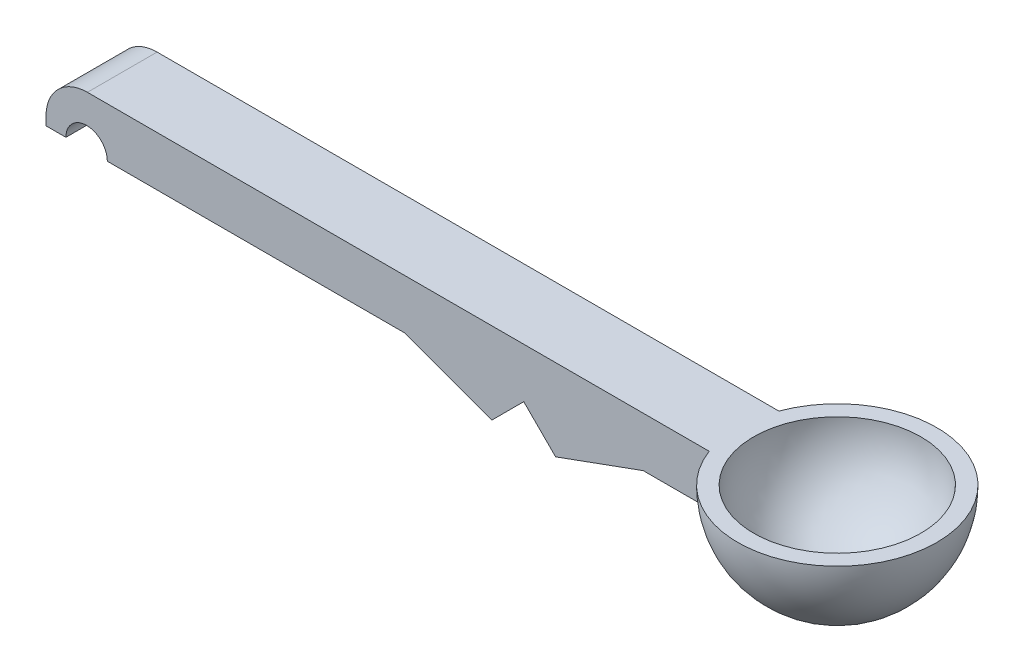
ISO-10303-21;
HEADER;
FILE_DESCRIPTION(('STEP AP214'),'2;1');
FILE_NAME('part.step','',(''),(''),'','','');
FILE_SCHEMA(('AUTOMOTIVE_DESIGN { 1 0 10303 214 1 1 1 1 }'));
ENDSEC;
DATA;
#1=APPLICATION_CONTEXT('core data for automotive mechanical design processes');
#2=APPLICATION_PROTOCOL_DEFINITION('international standard','automotive_design',2000,#1);
#3=PRODUCT_CONTEXT('',#1,'mechanical');
#4=PRODUCT('Part','Part','',(#3));
#5=PRODUCT_RELATED_PRODUCT_CATEGORY('part','',(#4));
#6=PRODUCT_DEFINITION_FORMATION('','',#4);
#7=PRODUCT_DEFINITION_CONTEXT('part definition',#1,'design');
#8=PRODUCT_DEFINITION('design','',#6,#7);
#9=PRODUCT_DEFINITION_SHAPE('','',#8);
#10=(LENGTH_UNIT() NAMED_UNIT(*) SI_UNIT(.MILLI.,.METRE.));
#11=(NAMED_UNIT(*) PLANE_ANGLE_UNIT() SI_UNIT($,.RADIAN.));
#12=(NAMED_UNIT(*) SI_UNIT($,.STERADIAN.) SOLID_ANGLE_UNIT());
#13=UNCERTAINTY_MEASURE_WITH_UNIT(LENGTH_MEASURE(1.E-05),#10,'distance_accuracy_value','');
#14=(GEOMETRIC_REPRESENTATION_CONTEXT(3) GLOBAL_UNCERTAINTY_ASSIGNED_CONTEXT((#13)) GLOBAL_UNIT_ASSIGNED_CONTEXT((#10,
#11,#12)) REPRESENTATION_CONTEXT('',''));
#15=CARTESIAN_POINT('',(0.,0.,0.));
#16=DIRECTION('',(0.,0.,1.));
#17=DIRECTION('',(1.,0.,0.));
#18=AXIS2_PLACEMENT_3D('',#15,#16,#17);
#19=CARTESIAN_POINT('',(107.95,7.9375,0.));
#20=DIRECTION('',(-1.,0.,0.));
#21=DIRECTION('',(0.,0.,1.));
#22=AXIS2_PLACEMENT_3D('',#19,#20,#21);
#23=PLANE('',#22);
#24=DIRECTION('',(0.,-1.,0.));
#25=VECTOR('',#24,1.);
#26=CARTESIAN_POINT('',(107.95,7.9375,-11.1125));
#27=LINE('',#26,#25);
#28=CARTESIAN_POINT('',(107.95,0.200981988807868,-11.1125));
#29=VERTEX_POINT('',#28);
#30=CARTESIAN_POINT('',(107.95,0.,-11.1125));
#31=VERTEX_POINT('',#30);
#32=EDGE_CURVE('E206',#29,#31,#27,.T.);
#33=ORIENTED_EDGE('',*,*,#32,.F.);
#34=CARTESIAN_POINT('',(107.95,7.9375,-5.55625000000001));
#35=DIRECTION('',(-1.,0.,0.));
#36=DIRECTION('',(0.,0.,1.));
#37=AXIS2_PLACEMENT_3D('',#34,#35,#36);
#38=CIRCLE('',#37,9.52500000000001);
#39=CARTESIAN_POINT('',(107.95,0.,-10.8213918546892));
#40=VERTEX_POINT('',#39);
#41=EDGE_CURVE('E173',#29,#40,#38,.T.);
#42=ORIENTED_EDGE('',*,*,#41,.T.);
#43=DIRECTION('',(0.,0.,-1.));
#44=VECTOR('',#43,1.);
#45=CARTESIAN_POINT('',(107.95,0.,0.));
#46=LINE('',#45,#44);
#47=EDGE_CURVE('E200',#40,#31,#46,.T.);
#48=ORIENTED_EDGE('',*,*,#47,.T.);
#49=EDGE_LOOP('',(#33,#42,#48));
#50=FACE_BOUND('',#49,.T.);
#51=ADVANCED_FACE('F56',(#50),#23,.F.);
#52=CARTESIAN_POINT('',(0.,0.,0.));
#53=DIRECTION('',(0.,-1.,0.));
#54=DIRECTION('',(0.,0.,-1.));
#55=AXIS2_PLACEMENT_3D('',#52,#53,#54);
#56=PLANE('',#55);
#57=CARTESIAN_POINT('',(16.129,0.,-5.55625));
#58=DIRECTION('',(0.,-1.,0.));
#59=DIRECTION('',(0.,0.,-1.));
#60=AXIS2_PLACEMENT_3D('',#57,#58,#59);
#61=CIRCLE('',#60,3.175);
#62=CARTESIAN_POINT('',(16.129,0.,-8.73125));
#63=VERTEX_POINT('',#62);
#64=EDGE_CURVE('E373',#63,#63,#61,.T.);
#65=ORIENTED_EDGE('',*,*,#64,.F.);
#66=EDGE_LOOP('',(#65));
#67=FACE_BOUND('',#66,.T.);
#68=DIRECTION('',(0.,0.,1.));
#69=VECTOR('',#68,1.);
#70=CARTESIAN_POINT('',(57.15,0.,-11.1125));
#71=LINE('',#70,#69);
#72=CARTESIAN_POINT('',(57.15,0.,-11.1125));
#73=VERTEX_POINT('',#72);
#74=CARTESIAN_POINT('',(57.15,0.,0.));
#75=VERTEX_POINT('',#74);
#76=EDGE_CURVE('E245',#73,#75,#71,.T.);
#77=ORIENTED_EDGE('',*,*,#76,.T.);
#78=DIRECTION('',(1.,0.,0.));
#79=VECTOR('',#78,1.);
#80=CARTESIAN_POINT('',(0.,0.,0.));
#81=LINE('',#80,#79);
#82=CARTESIAN_POINT('',(9.779,0.,0.));
#83=VERTEX_POINT('',#82);
#84=EDGE_CURVE('E201',#83,#75,#81,.T.);
#85=ORIENTED_EDGE('',*,*,#84,.F.);
#86=DIRECTION('',(0.,0.,-1.));
#87=VECTOR('',#86,1.);
#88=CARTESIAN_POINT('',(9.779,0.,136.012947812538));
#89=LINE('',#88,#87);
#90=CARTESIAN_POINT('',(9.779,0.,-11.1125));
#91=VERTEX_POINT('',#90);
#92=EDGE_CURVE('E211',#83,#91,#89,.T.);
#93=ORIENTED_EDGE('',*,*,#92,.T.);
#94=DIRECTION('',(-1.,0.,0.));
#95=VECTOR('',#94,1.);
#96=CARTESIAN_POINT('',(0.,0.,-11.1125));
#97=LINE('',#96,#95);
#98=EDGE_CURVE('E186',#73,#91,#97,.T.);
#99=ORIENTED_EDGE('',*,*,#98,.F.);
#100=EDGE_LOOP('',(#77,#85,#93,#99));
#101=FACE_BOUND('',#100,.T.);
#102=ADVANCED_FACE('F246',(#67,#101),#56,.T.);
#103=CARTESIAN_POINT('',(0.,7.9375,0.));
#104=DIRECTION('',(0.,0.,-1.));
#105=DIRECTION('',(-1.,0.,0.));
#106=AXIS2_PLACEMENT_3D('',#103,#104,#105);
#107=PLANE('',#106);
#108=DIRECTION('',(0.,-1.,0.));
#109=VECTOR('',#108,1.);
#110=CARTESIAN_POINT('',(107.95,7.9375,0.));
#111=LINE('',#110,#109);
#112=CARTESIAN_POINT('',(107.95,0.200981988807883,0.));
#113=VERTEX_POINT('',#112);
#114=CARTESIAN_POINT('',(107.95,0.,0.));
#115=VERTEX_POINT('',#114);
#116=EDGE_CURVE('E172',#113,#115,#111,.T.);
#117=ORIENTED_EDGE('',*,*,#116,.F.);
#118=CARTESIAN_POINT('',(120.65,7.9375,0.));
#119=DIRECTION('',(0.,0.,-1.));
#120=DIRECTION('',(-1.,0.,0.));
#121=AXIS2_PLACEMENT_3D('',#118,#119,#120);
#122=CIRCLE('',#121,14.8709014836862);
#123=CARTESIAN_POINT('',(105.779098516314,7.93749999999996,0.));
#124=VERTEX_POINT('',#123);
#125=EDGE_CURVE('E159',#113,#124,#122,.T.);
#126=ORIENTED_EDGE('',*,*,#125,.T.);
#127=DIRECTION('',(1.,0.,0.));
#128=VECTOR('',#127,1.);
#129=CARTESIAN_POINT('',(0.,7.9375,0.));
#130=LINE('',#129,#128);
#131=CARTESIAN_POINT('',(6.604,7.9375,0.));
#132=VERTEX_POINT('',#131);
#133=EDGE_CURVE('E170',#132,#124,#130,.T.);
#134=ORIENTED_EDGE('',*,*,#133,.F.);
#135=CARTESIAN_POINT('',(6.604,1.3335,0.));
#136=DIRECTION('',(0.,0.,-1.));
#137=DIRECTION('',(-1.,0.,0.));
#138=AXIS2_PLACEMENT_3D('',#135,#136,#137);
#139=CIRCLE('',#138,6.604);
#140=CARTESIAN_POINT('',(0.,1.3335,0.));
#141=VERTEX_POINT('',#140);
#142=EDGE_CURVE('E79',#132,#141,#139,.F.);
#143=ORIENTED_EDGE('',*,*,#142,.T.);
#144=DIRECTION('',(0.,-1.,0.));
#145=VECTOR('',#144,1.);
#146=CARTESIAN_POINT('',(0.,7.9375,0.));
#147=LINE('',#146,#145);
#148=CARTESIAN_POINT('',(0.,0.,0.));
#149=VERTEX_POINT('',#148);
#150=EDGE_CURVE('E209',#141,#149,#147,.T.);
#151=ORIENTED_EDGE('',*,*,#150,.T.);
#152=CARTESIAN_POINT('',(3.175,0.,0.));
#153=VERTEX_POINT('',#152);
#154=EDGE_CURVE('E197',#149,#153,#81,.T.);
#155=ORIENTED_EDGE('',*,*,#154,.T.);
#156=CARTESIAN_POINT('',(6.477,0.,0.));
#157=DIRECTION('',(0.,0.,-1.));
#158=DIRECTION('',(-1.,0.,0.));
#159=AXIS2_PLACEMENT_3D('',#156,#157,#158);
#160=CIRCLE('',#159,3.302);
#161=EDGE_CURVE('E190',#83,#153,#160,.F.);
#162=ORIENTED_EDGE('',*,*,#161,.F.);
#163=ORIENTED_EDGE('',*,*,#84,.T.);
#164=DIRECTION('',(0.939793423488437,-0.341743063086704,0.));
#165=VECTOR('',#164,1.);
#166=CARTESIAN_POINT('',(6.67445255474451,18.3547445255474,0.));
#167=LINE('',#166,#165);
#168=CARTESIAN_POINT('',(71.12,-5.08,0.));
#169=VERTEX_POINT('',#168);
#170=EDGE_CURVE('E279',#75,#169,#167,.T.);
#171=ORIENTED_EDGE('',*,*,#170,.T.);
#172=DIRECTION('',(0.707106781186546,0.707106781186549,0.));
#173=VECTOR('',#172,1.);
#174=CARTESIAN_POINT('',(38.1000000000002,-38.1,0.));
#175=LINE('',#174,#173);
#176=CARTESIAN_POINT('',(76.2,0.,0.));
#177=VERTEX_POINT('',#176);
#178=EDGE_CURVE('E284',#169,#177,#175,.T.);
#179=ORIENTED_EDGE('',*,*,#178,.T.);
#180=DIRECTION('',(0.707106781186547,-0.707106781186548,0.));
#181=VECTOR('',#180,1.);
#182=CARTESIAN_POINT('',(38.1000000000001,38.1,0.));
#183=LINE('',#182,#181);
#184=CARTESIAN_POINT('',(81.28,-5.08,0.));
#185=VERTEX_POINT('',#184);
#186=EDGE_CURVE('E277',#177,#185,#183,.T.);
#187=ORIENTED_EDGE('',*,*,#186,.T.);
#188=DIRECTION('',(0.939793423488437,0.341743063086704,0.));
#189=VECTOR('',#188,1.);
#190=CARTESIAN_POINT('',(11.1240875912409,-30.5912408759124,0.));
#191=LINE('',#190,#189);
#192=CARTESIAN_POINT('',(95.25,0.,0.));
#193=VERTEX_POINT('',#192);
#194=EDGE_CURVE('E253',#185,#193,#191,.T.);
#195=ORIENTED_EDGE('',*,*,#194,.T.);
#196=EDGE_CURVE('E196',#193,#115,#81,.T.);
#197=ORIENTED_EDGE('',*,*,#196,.T.);
#198=EDGE_LOOP('',(#117,#126,#134,#143,#151,#155,#162,#163,#171,#179,#187,#195,#197));
#199=FACE_BOUND('',#198,.T.);
#200=ADVANCED_FACE('F169',(#199),#107,.F.);
#201=CARTESIAN_POINT('',(0.,7.9375,-11.1125));
#202=DIRECTION('',(0.,0.,1.));
#203=DIRECTION('',(1.,0.,0.));
#204=AXIS2_PLACEMENT_3D('',#201,#202,#203);
#205=PLANE('',#204);
#206=DIRECTION('',(-1.,0.,0.));
#207=VECTOR('',#206,1.);
#208=CARTESIAN_POINT('',(0.,7.9375,-11.1125));
#209=LINE('',#208,#207);
#210=CARTESIAN_POINT('',(105.779098516314,7.93750000000004,-11.1125));
#211=VERTEX_POINT('',#210);
#212=CARTESIAN_POINT('',(6.604,7.9375,-11.1125));
#213=VERTEX_POINT('',#212);
#214=EDGE_CURVE('E180',#211,#213,#209,.T.);
#215=ORIENTED_EDGE('',*,*,#214,.F.);
#216=CARTESIAN_POINT('',(120.65,7.9375,-11.1125));
#217=DIRECTION('',(0.,0.,1.));
#218=DIRECTION('',(1.,0.,0.));
#219=AXIS2_PLACEMENT_3D('',#216,#217,#218);
#220=CIRCLE('',#219,14.8709014836862);
#221=EDGE_CURVE('E162',#211,#29,#220,.T.);
#222=ORIENTED_EDGE('',*,*,#221,.T.);
#223=ORIENTED_EDGE('',*,*,#32,.T.);
#224=CARTESIAN_POINT('',(95.25,0.,-11.1125));
#225=VERTEX_POINT('',#224);
#226=EDGE_CURVE('E181',#31,#225,#97,.T.);
#227=ORIENTED_EDGE('',*,*,#226,.T.);
#228=DIRECTION('',(0.939793423488437,0.341743063086704,0.));
#229=VECTOR('',#228,1.);
#230=CARTESIAN_POINT('',(11.1240875912409,-30.5912408759124,-11.1125));
#231=LINE('',#230,#229);
#232=CARTESIAN_POINT('',(81.28,-5.08,-11.1125));
#233=VERTEX_POINT('',#232);
#234=EDGE_CURVE('E274',#233,#225,#231,.T.);
#235=ORIENTED_EDGE('',*,*,#234,.F.);
#236=DIRECTION('',(0.707106781186547,-0.707106781186548,0.));
#237=VECTOR('',#236,1.);
#238=CARTESIAN_POINT('',(38.1000000000001,38.1,-11.1125));
#239=LINE('',#238,#237);
#240=CARTESIAN_POINT('',(76.2,0.,-11.1125));
#241=VERTEX_POINT('',#240);
#242=EDGE_CURVE('E267',#241,#233,#239,.T.);
#243=ORIENTED_EDGE('',*,*,#242,.F.);
#244=DIRECTION('',(0.707106781186546,0.707106781186549,0.));
#245=VECTOR('',#244,1.);
#246=CARTESIAN_POINT('',(38.1000000000002,-38.1,-11.1125));
#247=LINE('',#246,#245);
#248=CARTESIAN_POINT('',(71.12,-5.08,-11.1125));
#249=VERTEX_POINT('',#248);
#250=EDGE_CURVE('E283',#249,#241,#247,.T.);
#251=ORIENTED_EDGE('',*,*,#250,.F.);
#252=DIRECTION('',(0.939793423488437,-0.341743063086704,0.));
#253=VECTOR('',#252,1.);
#254=CARTESIAN_POINT('',(6.67445255474451,18.3547445255474,-11.1125));
#255=LINE('',#254,#253);
#256=EDGE_CURVE('E241',#73,#249,#255,.T.);
#257=ORIENTED_EDGE('',*,*,#256,.F.);
#258=ORIENTED_EDGE('',*,*,#98,.T.);
#259=CARTESIAN_POINT('',(6.477,0.,-11.1125));
#260=DIRECTION('',(0.,0.,1.));
#261=DIRECTION('',(1.,0.,0.));
#262=AXIS2_PLACEMENT_3D('',#259,#260,#261);
#263=CIRCLE('',#262,3.302);
#264=CARTESIAN_POINT('',(3.175,0.,-11.1124999999999));
#265=VERTEX_POINT('',#264);
#266=EDGE_CURVE('E236',#265,#91,#263,.F.);
#267=ORIENTED_EDGE('',*,*,#266,.F.);
#268=CARTESIAN_POINT('',(0.,0.,-11.1125));
#269=VERTEX_POINT('',#268);
#270=EDGE_CURVE('E188',#265,#269,#97,.T.);
#271=ORIENTED_EDGE('',*,*,#270,.T.);
#272=DIRECTION('',(0.,-1.,0.));
#273=VECTOR('',#272,1.);
#274=CARTESIAN_POINT('',(0.,7.9375,-11.1125));
#275=LINE('',#274,#273);
#276=CARTESIAN_POINT('',(0.,1.3335,-11.1125));
#277=VERTEX_POINT('',#276);
#278=EDGE_CURVE('E183',#277,#269,#275,.T.);
#279=ORIENTED_EDGE('',*,*,#278,.F.);
#280=CARTESIAN_POINT('',(6.604,1.3335,-11.1125));
#281=DIRECTION('',(0.,0.,1.));
#282=DIRECTION('',(1.,0.,0.));
#283=AXIS2_PLACEMENT_3D('',#280,#281,#282);
#284=CIRCLE('',#283,6.604);
#285=EDGE_CURVE('E12',#277,#213,#284,.F.);
#286=ORIENTED_EDGE('',*,*,#285,.T.);
#287=EDGE_LOOP('',(#215,#222,#223,#227,#235,#243,#251,#257,#258,#267,#271,#279,#286));
#288=FACE_BOUND('',#287,.T.);
#289=ADVANCED_FACE('F235',(#288),#205,.F.);
#290=ORIENTED_EDGE('',*,*,#270,.F.);
#291=DIRECTION('',(0.,0.,-1.));
#292=VECTOR('',#291,1.);
#293=CARTESIAN_POINT('',(3.175,0.,136.012947812538));
#294=LINE('',#293,#292);
#295=EDGE_CURVE('E214',#265,#153,#294,.F.);
#296=ORIENTED_EDGE('',*,*,#295,.T.);
#297=ORIENTED_EDGE('',*,*,#154,.F.);
#298=DIRECTION('',(0.,0.,1.));
#299=VECTOR('',#298,1.);
#300=CARTESIAN_POINT('',(0.,0.,0.));
#301=LINE('',#300,#299);
#302=EDGE_CURVE('E193',#269,#149,#301,.T.);
#303=ORIENTED_EDGE('',*,*,#302,.F.);
#304=EDGE_LOOP('',(#290,#296,#297,#303));
#305=FACE_BOUND('',#304,.T.);
#306=ADVANCED_FACE('F222',(#305),#56,.T.);
#307=CARTESIAN_POINT('',(120.65,0.,-5.55625000000001));
#308=DIRECTION('',(0.,-1.,0.));
#309=DIRECTION('',(0.,0.,-1.));
#310=AXIS2_PLACEMENT_3D('',#307,#308,#309);
#311=CIRCLE('',#310,13.748153285078);
#312=CARTESIAN_POINT('',(107.95,0.,-0.2911081453108));
#313=VERTEX_POINT('',#312);
#314=EDGE_CURVE('E174',#313,#40,#311,.T.);
#315=ORIENTED_EDGE('',*,*,#314,.F.);
#316=EDGE_CURVE('E202',#115,#313,#46,.T.);
#317=ORIENTED_EDGE('',*,*,#316,.F.);
#318=ORIENTED_EDGE('',*,*,#196,.F.);
#319=DIRECTION('',(0.,0.,1.));
#320=VECTOR('',#319,1.);
#321=CARTESIAN_POINT('',(95.25,0.,-11.1125));
#322=LINE('',#321,#320);
#323=EDGE_CURVE('E275',#225,#193,#322,.T.);
#324=ORIENTED_EDGE('',*,*,#323,.F.);
#325=ORIENTED_EDGE('',*,*,#226,.F.);
#326=ORIENTED_EDGE('',*,*,#47,.F.);
#327=EDGE_LOOP('',(#315,#317,#318,#324,#325,#326));
#328=FACE_BOUND('',#327,.T.);
#329=ADVANCED_FACE('F257',(#328),#56,.T.);
#330=CARTESIAN_POINT('',(0.,7.9375,0.));
#331=DIRECTION('',(1.,0.,0.));
#332=DIRECTION('',(0.,0.,-1.));
#333=AXIS2_PLACEMENT_3D('',#330,#331,#332);
#334=PLANE('',#333);
#335=ORIENTED_EDGE('',*,*,#150,.F.);
#336=DIRECTION('',(0.,0.,1.));
#337=VECTOR('',#336,1.);
#338=CARTESIAN_POINT('',(0.,1.3335,0.));
#339=LINE('',#338,#337);
#340=EDGE_CURVE('E65',#141,#277,#339,.F.);
#341=ORIENTED_EDGE('',*,*,#340,.T.);
#342=ORIENTED_EDGE('',*,*,#278,.T.);
#343=ORIENTED_EDGE('',*,*,#302,.T.);
#344=EDGE_LOOP('',(#335,#341,#342,#343));
#345=FACE_BOUND('',#344,.T.);
#346=ADVANCED_FACE('F231',(#345),#334,.F.);
#347=ORIENTED_EDGE('',*,*,#316,.T.);
#348=EDGE_CURVE('E166',#313,#113,#38,.T.);
#349=ORIENTED_EDGE('',*,*,#348,.T.);
#350=ORIENTED_EDGE('',*,*,#116,.T.);
#351=EDGE_LOOP('',(#347,#349,#350));
#352=FACE_BOUND('',#351,.T.);
#353=ADVANCED_FACE('F260',(#352),#23,.F.);
#354=CARTESIAN_POINT('',(0.,7.9375,0.));
#355=DIRECTION('',(0.,-1.,0.));
#356=DIRECTION('',(0.,0.,-1.));
#357=AXIS2_PLACEMENT_3D('',#354,#355,#356);
#358=PLANE('',#357);
#359=CARTESIAN_POINT('',(120.65,7.9375,-5.55625000000001));
#360=DIRECTION('',(0.,-1.,0.));
#361=DIRECTION('',(0.,0.,-1.));
#362=AXIS2_PLACEMENT_3D('',#359,#360,#361);
#363=CIRCLE('',#362,13.335);
#364=CARTESIAN_POINT('',(120.65,7.9375,-18.89125));
#365=VERTEX_POINT('',#364);
#366=EDGE_CURVE('E60',#365,#365,#363,.F.);
#367=ORIENTED_EDGE('',*,*,#366,.F.);
#368=EDGE_LOOP('',(#367));
#369=FACE_BOUND('',#368,.T.);
#370=CARTESIAN_POINT('',(120.65,7.9375,-5.55625000000001));
#371=DIRECTION('',(0.,-1.,0.));
#372=DIRECTION('',(0.,0.,-1.));
#373=AXIS2_PLACEMENT_3D('',#370,#371,#372);
#374=CIRCLE('',#373,15.875);
#375=EDGE_CURVE('E156',#211,#124,#374,.T.);
#376=ORIENTED_EDGE('',*,*,#375,.F.);
#377=ORIENTED_EDGE('',*,*,#214,.T.);
#378=DIRECTION('',(0.,0.,1.));
#379=VECTOR('',#378,1.);
#380=CARTESIAN_POINT('',(6.604,7.9375,0.));
#381=LINE('',#380,#379);
#382=EDGE_CURVE('E179',#213,#132,#381,.T.);
#383=ORIENTED_EDGE('',*,*,#382,.T.);
#384=ORIENTED_EDGE('',*,*,#133,.T.);
#385=EDGE_LOOP('',(#376,#377,#383,#384));
#386=FACE_BOUND('',#385,.T.);
#387=ADVANCED_FACE('F177',(#369,#386),#358,.F.);
#388=CARTESIAN_POINT('',(6.477,0.,136.012947812538));
#389=DIRECTION('',(0.,0.,-1.));
#390=DIRECTION('',(-1.,0.,0.));
#391=AXIS2_PLACEMENT_3D('',#388,#389,#390);
#392=CYLINDRICAL_SURFACE('',#391,3.302);
#393=ORIENTED_EDGE('',*,*,#92,.F.);
#394=ORIENTED_EDGE('',*,*,#161,.T.);
#395=ORIENTED_EDGE('',*,*,#295,.F.);
#396=ORIENTED_EDGE('',*,*,#266,.T.);
#397=EDGE_LOOP('',(#393,#394,#395,#396));
#398=FACE_BOUND('',#397,.T.);
#399=ADVANCED_FACE('F244',(#398),#392,.F.);
#400=CARTESIAN_POINT('',(6.67445255474451,18.3547445255474,-11.1125));
#401=DIRECTION('',(-0.341743063086704,-0.939793423488437,0.));
#402=DIRECTION('',(0.939793423488437,-0.341743063086704,0.));
#403=AXIS2_PLACEMENT_3D('',#400,#401,#402);
#404=PLANE('',#403);
#405=ORIENTED_EDGE('',*,*,#170,.F.);
#406=ORIENTED_EDGE('',*,*,#76,.F.);
#407=ORIENTED_EDGE('',*,*,#256,.T.);
#408=DIRECTION('',(0.,0.,1.));
#409=VECTOR('',#408,1.);
#410=CARTESIAN_POINT('',(71.12,-5.08,-11.1125));
#411=LINE('',#410,#409);
#412=EDGE_CURVE('E287',#249,#169,#411,.T.);
#413=ORIENTED_EDGE('',*,*,#412,.T.);
#414=EDGE_LOOP('',(#405,#406,#407,#413));
#415=FACE_BOUND('',#414,.T.);
#416=ADVANCED_FACE('F297',(#415),#404,.T.);
#417=CARTESIAN_POINT('',(38.1000000000002,-38.1,-11.1125));
#418=DIRECTION('',(0.707106781186549,-0.707106781186546,0.));
#419=DIRECTION('',(0.707106781186546,0.707106781186549,0.));
#420=AXIS2_PLACEMENT_3D('',#417,#418,#419);
#421=PLANE('',#420);
#422=ORIENTED_EDGE('',*,*,#178,.F.);
#423=ORIENTED_EDGE('',*,*,#412,.F.);
#424=ORIENTED_EDGE('',*,*,#250,.T.);
#425=DIRECTION('',(0.,0.,1.));
#426=VECTOR('',#425,1.);
#427=CARTESIAN_POINT('',(76.2,0.,-11.1125));
#428=LINE('',#427,#426);
#429=EDGE_CURVE('E292',#241,#177,#428,.T.);
#430=ORIENTED_EDGE('',*,*,#429,.T.);
#431=EDGE_LOOP('',(#422,#423,#424,#430));
#432=FACE_BOUND('',#431,.T.);
#433=ADVANCED_FACE('F299',(#432),#421,.T.);
#434=CARTESIAN_POINT('',(38.1000000000001,38.1,-11.1125));
#435=DIRECTION('',(-0.707106781186548,-0.707106781186547,0.));
#436=DIRECTION('',(0.707106781186547,-0.707106781186548,0.));
#437=AXIS2_PLACEMENT_3D('',#434,#435,#436);
#438=PLANE('',#437);
#439=ORIENTED_EDGE('',*,*,#186,.F.);
#440=ORIENTED_EDGE('',*,*,#429,.F.);
#441=ORIENTED_EDGE('',*,*,#242,.T.);
#442=DIRECTION('',(0.,0.,1.));
#443=VECTOR('',#442,1.);
#444=CARTESIAN_POINT('',(81.28,-5.08,-11.1125));
#445=LINE('',#444,#443);
#446=EDGE_CURVE('E270',#233,#185,#445,.T.);
#447=ORIENTED_EDGE('',*,*,#446,.T.);
#448=EDGE_LOOP('',(#439,#440,#441,#447));
#449=FACE_BOUND('',#448,.T.);
#450=ADVANCED_FACE('F301',(#449),#438,.T.);
#451=CARTESIAN_POINT('',(11.1240875912409,-30.5912408759124,-11.1125));
#452=DIRECTION('',(0.341743063086704,-0.939793423488437,0.));
#453=DIRECTION('',(0.939793423488437,0.341743063086704,0.));
#454=AXIS2_PLACEMENT_3D('',#451,#452,#453);
#455=PLANE('',#454);
#456=ORIENTED_EDGE('',*,*,#194,.F.);
#457=ORIENTED_EDGE('',*,*,#446,.F.);
#458=ORIENTED_EDGE('',*,*,#234,.T.);
#459=ORIENTED_EDGE('',*,*,#323,.T.);
#460=EDGE_LOOP('',(#456,#457,#458,#459));
#461=FACE_BOUND('',#460,.T.);
#462=ADVANCED_FACE('F305',(#461),#455,.T.);
#463=CARTESIAN_POINT('',(6.604,1.3335,0.));
#464=DIRECTION('',(0.,0.,1.));
#465=DIRECTION('',(1.,0.,0.));
#466=AXIS2_PLACEMENT_3D('',#463,#464,#465);
#467=CYLINDRICAL_SURFACE('',#466,6.604);
#468=ORIENTED_EDGE('',*,*,#285,.F.);
#469=ORIENTED_EDGE('',*,*,#340,.F.);
#470=ORIENTED_EDGE('',*,*,#142,.F.);
#471=ORIENTED_EDGE('',*,*,#382,.F.);
#472=EDGE_LOOP('',(#468,#469,#470,#471));
#473=FACE_BOUND('',#472,.T.);
#474=ADVANCED_FACE('F58',(#473),#467,.T.);
#475=CARTESIAN_POINT('',(120.65,7.9375,-5.55625000000001));
#476=DIRECTION('',(-1.,0.,0.));
#477=DIRECTION('',(0.,0.,1.));
#478=AXIS2_PLACEMENT_3D('',#475,#476,#477);
#479=SPHERICAL_SURFACE('',#478,15.875);
#480=ORIENTED_EDGE('',*,*,#221,.F.);
#481=ORIENTED_EDGE('',*,*,#375,.T.);
#482=ORIENTED_EDGE('',*,*,#125,.F.);
#483=ORIENTED_EDGE('',*,*,#348,.F.);
#484=ORIENTED_EDGE('',*,*,#314,.T.);
#485=ORIENTED_EDGE('',*,*,#41,.F.);
#486=EDGE_LOOP('',(#480,#481,#482,#483,#484,#485));
#487=FACE_BOUND('',#486,.T.);
#488=ADVANCED_FACE('F158',(#487),#479,.T.);
#489=CARTESIAN_POINT('',(120.65,7.9375,-5.55625000000001));
#490=DIRECTION('',(1.,0.,0.));
#491=DIRECTION('',(0.,0.,1.));
#492=AXIS2_PLACEMENT_3D('',#489,#490,#491);
#493=SPHERICAL_SURFACE('',#492,13.335);
#494=CARTESIAN_POINT('',(120.65,7.9375,-5.55625000000001));
#495=DIRECTION('',(0.,-1.,0.));
#496=DIRECTION('',(0.,0.,-1.));
#497=AXIS2_PLACEMENT_3D('',#494,#495,#496);
#498=SPHERICAL_SURFACE('',#497,13.335);
#499=ORIENTED_EDGE('',*,*,#366,.T.);
#500=EDGE_LOOP('',(#499));
#501=FACE_BOUND('',#500,.T.);
#502=ADVANCED_FACE('F346',(#501),#498,.F.);
#503=CARTESIAN_POINT('',(16.129,4.953,-5.55625));
#504=DIRECTION('',(0.,1.,0.));
#505=DIRECTION('',(0.,0.,1.));
#506=AXIS2_PLACEMENT_3D('',#503,#504,#505);
#507=PLANE('',#506);
#508=CARTESIAN_POINT('',(16.129,4.953,-5.55625));
#509=DIRECTION('',(0.,-1.,0.));
#510=DIRECTION('',(0.,0.,-1.));
#511=AXIS2_PLACEMENT_3D('',#508,#509,#510);
#512=CIRCLE('',#511,3.556);
#513=CARTESIAN_POINT('',(16.129,4.953,-9.11225));
#514=VERTEX_POINT('',#513);
#515=EDGE_CURVE('E380',#514,#514,#512,.T.);
#516=ORIENTED_EDGE('',*,*,#515,.T.);
#517=EDGE_LOOP('',(#516));
#518=FACE_BOUND('',#517,.T.);
#519=ADVANCED_FACE('F349',(#518),#507,.F.);
#520=CARTESIAN_POINT('',(16.129,0.,-5.55625));
#521=DIRECTION('',(0.,-1.,0.));
#522=DIRECTION('',(0.,0.,-1.));
#523=AXIS2_PLACEMENT_3D('',#520,#521,#522);
#524=CYLINDRICAL_SURFACE('',#523,3.556);
#525=ORIENTED_EDGE('',*,*,#515,.F.);
#526=EDGE_LOOP('',(#525));
#527=FACE_BOUND('',#526,.T.);
#528=CARTESIAN_POINT('',(16.129,3.175,-5.55625));
#529=DIRECTION('',(0.,-1.,0.));
#530=DIRECTION('',(0.,0.,-1.));
#531=AXIS2_PLACEMENT_3D('',#528,#529,#530);
#532=CIRCLE('',#531,3.556);
#533=CARTESIAN_POINT('',(16.129,3.175,-9.11225));
#534=VERTEX_POINT('',#533);
#535=EDGE_CURVE('E375',#534,#534,#532,.T.);
#536=ORIENTED_EDGE('',*,*,#535,.T.);
#537=EDGE_LOOP('',(#536));
#538=FACE_BOUND('',#537,.T.);
#539=ADVANCED_FACE('F353',(#527,#538),#524,.F.);
#540=CARTESIAN_POINT('',(19.304,3.175,-5.55625));
#541=DIRECTION('',(0.,-1.,0.));
#542=DIRECTION('',(0.,0.,-1.));
#543=AXIS2_PLACEMENT_3D('',#540,#541,#542);
#544=PLANE('',#543);
#545=ORIENTED_EDGE('',*,*,#535,.F.);
#546=EDGE_LOOP('',(#545));
#547=FACE_BOUND('',#546,.T.);
#548=CARTESIAN_POINT('',(16.129,3.175,-5.55625));
#549=DIRECTION('',(0.,-1.,0.));
#550=DIRECTION('',(0.,0.,-1.));
#551=AXIS2_PLACEMENT_3D('',#548,#549,#550);
#552=CIRCLE('',#551,3.175);
#553=CARTESIAN_POINT('',(16.129,3.175,-8.73125));
#554=VERTEX_POINT('',#553);
#555=EDGE_CURVE('E370',#554,#554,#552,.T.);
#556=ORIENTED_EDGE('',*,*,#555,.T.);
#557=EDGE_LOOP('',(#556));
#558=FACE_BOUND('',#557,.T.);
#559=ADVANCED_FACE('F357',(#547,#558),#544,.F.);
#560=CARTESIAN_POINT('',(16.129,0.,-5.55625));
#561=DIRECTION('',(0.,-1.,0.));
#562=DIRECTION('',(0.,0.,-1.));
#563=AXIS2_PLACEMENT_3D('',#560,#561,#562);
#564=CYLINDRICAL_SURFACE('',#563,3.175);
#565=ORIENTED_EDGE('',*,*,#555,.F.);
#566=EDGE_LOOP('',(#565));
#567=FACE_BOUND('',#566,.T.);
#568=ORIENTED_EDGE('',*,*,#64,.T.);
#569=EDGE_LOOP('',(#568));
#570=FACE_BOUND('',#569,.T.);
#571=ADVANCED_FACE('F361',(#567,#570),#564,.F.);
#572=CLOSED_SHELL('',(#51,#102,#200,#289,#306,#329,#346,#353,#387,#399,#416,#433,#450,#462,#474,
#488,#502,#519,#539,#559,#571));
#573=MANIFOLD_SOLID_BREP('B2',#572);
#574=ADVANCED_BREP_SHAPE_REPRESENTATION('',(#18,#573),#14);
#575=SHAPE_DEFINITION_REPRESENTATION(#9,#574);
ENDSEC;
END-ISO-10303-21;
